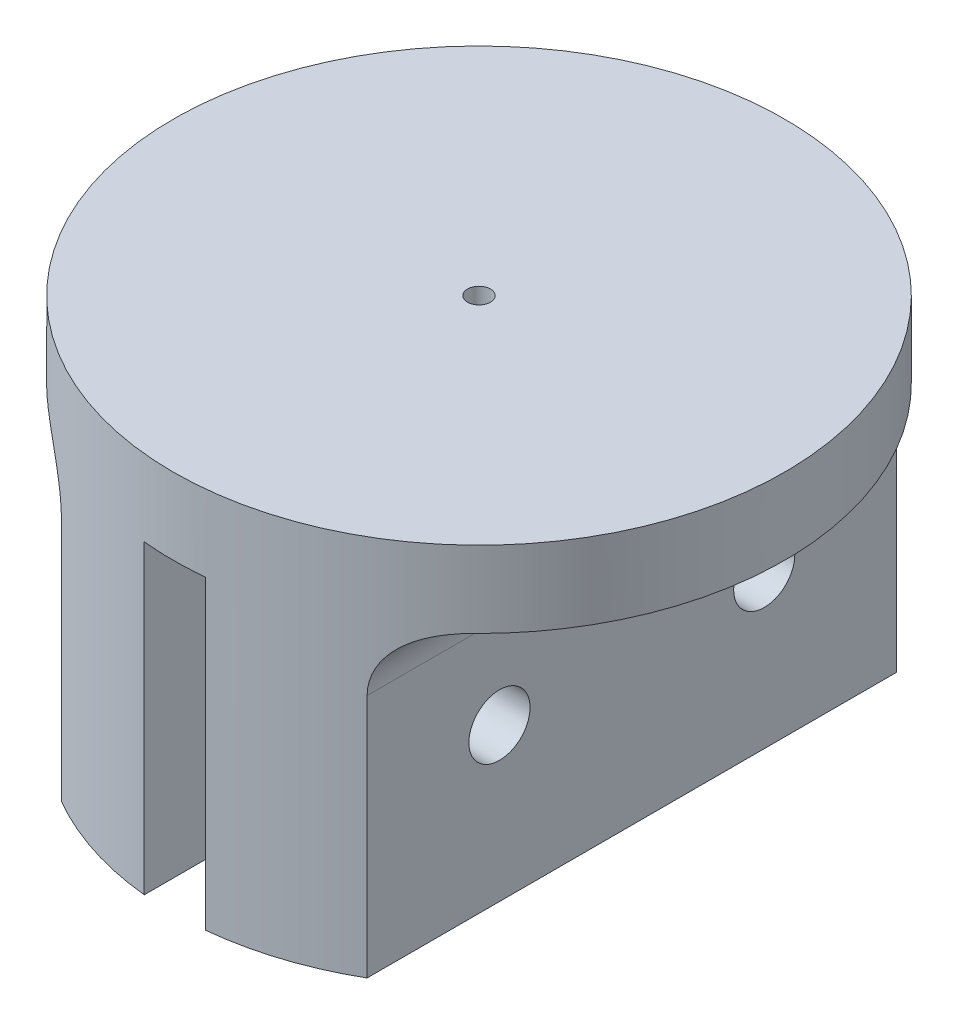
ISO-10303-21;
HEADER;
FILE_DESCRIPTION(('STEP AP214'),'2;1');
FILE_NAME('part.step','',(''),(''),'','','');
FILE_SCHEMA(('AUTOMOTIVE_DESIGN { 1 0 10303 214 1 1 1 1 }'));
ENDSEC;
DATA;
#1=APPLICATION_CONTEXT('core data for automotive mechanical design processes');
#2=APPLICATION_PROTOCOL_DEFINITION('international standard','automotive_design',2000,#1);
#3=PRODUCT_CONTEXT('',#1,'mechanical');
#4=PRODUCT('Part','Part','',(#3));
#5=PRODUCT_RELATED_PRODUCT_CATEGORY('part','',(#4));
#6=PRODUCT_DEFINITION_FORMATION('','',#4);
#7=PRODUCT_DEFINITION_CONTEXT('part definition',#1,'design');
#8=PRODUCT_DEFINITION('design','',#6,#7);
#9=PRODUCT_DEFINITION_SHAPE('','',#8);
#10=(LENGTH_UNIT() NAMED_UNIT(*) SI_UNIT(.MILLI.,.METRE.));
#11=(NAMED_UNIT(*) PLANE_ANGLE_UNIT() SI_UNIT($,.RADIAN.));
#12=(NAMED_UNIT(*) SI_UNIT($,.STERADIAN.) SOLID_ANGLE_UNIT());
#13=UNCERTAINTY_MEASURE_WITH_UNIT(LENGTH_MEASURE(1.E-05),#10,'distance_accuracy_value','');
#14=(GEOMETRIC_REPRESENTATION_CONTEXT(3) GLOBAL_UNCERTAINTY_ASSIGNED_CONTEXT((#13)) GLOBAL_UNIT_ASSIGNED_CONTEXT((#10,
#11,#12)) REPRESENTATION_CONTEXT('',''));
#15=CARTESIAN_POINT('',(0.,0.,0.));
#16=DIRECTION('',(0.,0.,1.));
#17=DIRECTION('',(1.,0.,0.));
#18=AXIS2_PLACEMENT_3D('',#15,#16,#17);
#19=CARTESIAN_POINT('',(-2.,20.,-20.7716194546899));
#20=DIRECTION('',(1.,0.,0.));
#21=DIRECTION('',(0.,0.,-1.));
#22=AXIS2_PLACEMENT_3D('',#19,#20,#21);
#23=PLANE('',#22);
#24=CARTESIAN_POINT('',(-1.99999999999999,10.,8.66025403784438));
#25=DIRECTION('',(1.,0.,0.));
#26=DIRECTION('',(0.,0.,-1.));
#27=AXIS2_PLACEMENT_3D('',#24,#25,#26);
#28=CIRCLE('',#27,2.);
#29=CARTESIAN_POINT('',(-2.,10.,6.66025403784438));
#30=VERTEX_POINT('',#29);
#31=EDGE_CURVE('E133',#30,#30,#28,.F.);
#32=ORIENTED_EDGE('',*,*,#31,.T.);
#33=EDGE_LOOP('',(#32));
#34=FACE_BOUND('',#33,.T.);
#35=DIRECTION('',(0.,-1.,0.));
#36=VECTOR('',#35,1.);
#37=CARTESIAN_POINT('',(-1.99999999999999,25.,19.8997487421324));
#38=LINE('',#37,#36);
#39=CARTESIAN_POINT('',(-1.99999999999999,20.,19.8997487421324));
#40=VERTEX_POINT('',#39);
#41=CARTESIAN_POINT('',(-1.99999999999999,0.,19.8997487421324));
#42=VERTEX_POINT('',#41);
#43=EDGE_CURVE('E165',#40,#42,#38,.T.);
#44=ORIENTED_EDGE('',*,*,#43,.T.);
#45=DIRECTION('',(0.,0.,1.));
#46=VECTOR('',#45,1.);
#47=CARTESIAN_POINT('',(-2.,0.,-20.7716194546899));
#48=LINE('',#47,#46);
#49=CARTESIAN_POINT('',(-2.,0.,-19.8997487421324));
#50=VERTEX_POINT('',#49);
#51=EDGE_CURVE('E261',#50,#42,#48,.T.);
#52=ORIENTED_EDGE('',*,*,#51,.F.);
#53=DIRECTION('',(0.,-1.,0.));
#54=VECTOR('',#53,1.);
#55=CARTESIAN_POINT('',(-2.,25.,-19.8997487421324));
#56=LINE('',#55,#54);
#57=CARTESIAN_POINT('',(-2.,20.,-19.8997487421324));
#58=VERTEX_POINT('',#57);
#59=EDGE_CURVE('E176',#50,#58,#56,.F.);
#60=ORIENTED_EDGE('',*,*,#59,.T.);
#61=DIRECTION('',(0.,0.,1.));
#62=VECTOR('',#61,1.);
#63=CARTESIAN_POINT('',(-2.,20.,-20.7716194546899));
#64=LINE('',#63,#62);
#65=EDGE_CURVE('E268',#58,#40,#64,.T.);
#66=ORIENTED_EDGE('',*,*,#65,.T.);
#67=EDGE_LOOP('',(#44,#52,#60,#66));
#68=FACE_BOUND('',#67,.T.);
#69=CARTESIAN_POINT('',(-2.,10.,-8.66025403784438));
#70=DIRECTION('',(1.,0.,0.));
#71=DIRECTION('',(0.,0.,-1.));
#72=AXIS2_PLACEMENT_3D('',#69,#70,#71);
#73=CIRCLE('',#72,2.);
#74=CARTESIAN_POINT('',(-2.,10.,-10.6602540378444));
#75=VERTEX_POINT('',#74);
#76=EDGE_CURVE('E191',#75,#75,#73,.F.);
#77=ORIENTED_EDGE('',*,*,#76,.T.);
#78=EDGE_LOOP('',(#77));
#79=FACE_BOUND('',#78,.T.);
#80=ADVANCED_FACE('F33',(#34,#68,#79),#23,.T.);
#81=CARTESIAN_POINT('',(2.,20.,-20.7716194546899));
#82=DIRECTION('',(-1.,0.,0.));
#83=DIRECTION('',(0.,0.,1.));
#84=AXIS2_PLACEMENT_3D('',#81,#82,#83);
#85=PLANE('',#84);
#86=CARTESIAN_POINT('',(2.,10.,8.66025403784438));
#87=DIRECTION('',(-1.,0.,0.));
#88=DIRECTION('',(0.,0.,1.));
#89=AXIS2_PLACEMENT_3D('',#86,#87,#88);
#90=CIRCLE('',#89,2.);
#91=CARTESIAN_POINT('',(2.,10.,10.6602540378444));
#92=VERTEX_POINT('',#91);
#93=EDGE_CURVE('E277',#92,#92,#90,.F.);
#94=ORIENTED_EDGE('',*,*,#93,.T.);
#95=EDGE_LOOP('',(#94));
#96=FACE_BOUND('',#95,.T.);
#97=DIRECTION('',(0.,-1.,0.));
#98=VECTOR('',#97,1.);
#99=CARTESIAN_POINT('',(2.,25.,-19.8997487421324));
#100=LINE('',#99,#98);
#101=CARTESIAN_POINT('',(2.,20.,-19.8997487421324));
#102=VERTEX_POINT('',#101);
#103=CARTESIAN_POINT('',(2.,0.,-19.8997487421324));
#104=VERTEX_POINT('',#103);
#105=EDGE_CURVE('E171',#102,#104,#100,.T.);
#106=ORIENTED_EDGE('',*,*,#105,.T.);
#107=DIRECTION('',(0.,0.,-1.));
#108=VECTOR('',#107,1.);
#109=CARTESIAN_POINT('',(2.,0.,-20.7716194546899));
#110=LINE('',#109,#108);
#111=CARTESIAN_POINT('',(2.00000000000001,0.,19.8997487421324));
#112=VERTEX_POINT('',#111);
#113=EDGE_CURVE('E137',#112,#104,#110,.T.);
#114=ORIENTED_EDGE('',*,*,#113,.F.);
#115=DIRECTION('',(0.,-1.,0.));
#116=VECTOR('',#115,1.);
#117=CARTESIAN_POINT('',(2.00000000000001,25.,19.8997487421324));
#118=LINE('',#117,#116);
#119=CARTESIAN_POINT('',(2.00000000000001,20.,19.8997487421324));
#120=VERTEX_POINT('',#119);
#121=EDGE_CURVE('E161',#112,#120,#118,.F.);
#122=ORIENTED_EDGE('',*,*,#121,.T.);
#123=DIRECTION('',(0.,0.,-1.));
#124=VECTOR('',#123,1.);
#125=CARTESIAN_POINT('',(2.,20.,-20.7716194546899));
#126=LINE('',#125,#124);
#127=EDGE_CURVE('E270',#120,#102,#126,.T.);
#128=ORIENTED_EDGE('',*,*,#127,.T.);
#129=EDGE_LOOP('',(#106,#114,#122,#128));
#130=FACE_BOUND('',#129,.T.);
#131=CARTESIAN_POINT('',(2.,10.,-8.66025403784438));
#132=DIRECTION('',(-1.,0.,0.));
#133=DIRECTION('',(0.,0.,1.));
#134=AXIS2_PLACEMENT_3D('',#131,#132,#133);
#135=CIRCLE('',#134,2.);
#136=CARTESIAN_POINT('',(2.,10.,-6.66025403784438));
#137=VERTEX_POINT('',#136);
#138=EDGE_CURVE('E284',#137,#137,#135,.F.);
#139=ORIENTED_EDGE('',*,*,#138,.T.);
#140=EDGE_LOOP('',(#139));
#141=FACE_BOUND('',#140,.T.);
#142=ADVANCED_FACE('F230',(#96,#130,#141),#85,.T.);
#143=CARTESIAN_POINT('',(-10.,20.,-20.));
#144=DIRECTION('',(-1.,0.,0.));
#145=DIRECTION('',(0.,0.,1.));
#146=AXIS2_PLACEMENT_3D('',#143,#144,#145);
#147=PLANE('',#146);
#148=CARTESIAN_POINT('',(-9.99999999999999,10.,8.66025403784438));
#149=DIRECTION('',(-1.,0.,0.));
#150=DIRECTION('',(0.,0.,1.));
#151=AXIS2_PLACEMENT_3D('',#148,#149,#150);
#152=CIRCLE('',#151,2.);
#153=CARTESIAN_POINT('',(-9.99999999999999,10.,10.6602540378444));
#154=VERTEX_POINT('',#153);
#155=EDGE_CURVE('E190',#154,#154,#152,.F.);
#156=ORIENTED_EDGE('',*,*,#155,.T.);
#157=EDGE_LOOP('',(#156));
#158=FACE_BOUND('',#157,.T.);
#159=DIRECTION('',(0.,-1.,0.));
#160=VECTOR('',#159,1.);
#161=CARTESIAN_POINT('',(-9.99999999999999,25.,17.3205080756888));
#162=LINE('',#161,#160);
#163=CARTESIAN_POINT('',(-9.99999999999999,0.,17.3205080756888));
#164=VERTEX_POINT('',#163);
#165=CARTESIAN_POINT('',(-9.99999999999999,16.,17.3205080756888));
#166=VERTEX_POINT('',#165);
#167=EDGE_CURVE('E181',#164,#166,#162,.F.);
#168=ORIENTED_EDGE('',*,*,#167,.T.);
#169=DIRECTION('',(0.,0.,-1.));
#170=VECTOR('',#169,1.);
#171=CARTESIAN_POINT('',(-10.,16.,-20.));
#172=LINE('',#171,#170);
#173=CARTESIAN_POINT('',(-10.,16.,-17.3205080756888));
#174=VERTEX_POINT('',#173);
#175=EDGE_CURVE('E186',#166,#174,#172,.T.);
#176=ORIENTED_EDGE('',*,*,#175,.T.);
#177=DIRECTION('',(0.,-1.,0.));
#178=VECTOR('',#177,1.);
#179=CARTESIAN_POINT('',(-10.,25.,-17.3205080756888));
#180=LINE('',#179,#178);
#181=CARTESIAN_POINT('',(-10.,0.,-17.3205080756888));
#182=VERTEX_POINT('',#181);
#183=EDGE_CURVE('E126',#174,#182,#180,.T.);
#184=ORIENTED_EDGE('',*,*,#183,.T.);
#185=DIRECTION('',(0.,0.,-1.));
#186=VECTOR('',#185,1.);
#187=CARTESIAN_POINT('',(-10.,0.,-20.));
#188=LINE('',#187,#186);
#189=EDGE_CURVE('E258',#164,#182,#188,.T.);
#190=ORIENTED_EDGE('',*,*,#189,.F.);
#191=EDGE_LOOP('',(#168,#176,#184,#190));
#192=FACE_BOUND('',#191,.T.);
#193=CARTESIAN_POINT('',(-10.,10.,-8.66025403784438));
#194=DIRECTION('',(-1.,0.,0.));
#195=DIRECTION('',(0.,0.,1.));
#196=AXIS2_PLACEMENT_3D('',#193,#194,#195);
#197=CIRCLE('',#196,2.);
#198=CARTESIAN_POINT('',(-10.,10.,-6.66025403784438));
#199=VERTEX_POINT('',#198);
#200=EDGE_CURVE('E195',#199,#199,#197,.F.);
#201=ORIENTED_EDGE('',*,*,#200,.T.);
#202=EDGE_LOOP('',(#201));
#203=FACE_BOUND('',#202,.T.);
#204=ADVANCED_FACE('F236',(#158,#192,#203),#147,.T.);
#205=CARTESIAN_POINT('',(10.,20.,-20.7716194546899));
#206=DIRECTION('',(1.,0.,0.));
#207=DIRECTION('',(0.,0.,-1.));
#208=AXIS2_PLACEMENT_3D('',#205,#206,#207);
#209=PLANE('',#208);
#210=CARTESIAN_POINT('',(10.,10.,8.66025403784438));
#211=DIRECTION('',(1.,0.,0.));
#212=DIRECTION('',(0.,0.,-1.));
#213=AXIS2_PLACEMENT_3D('',#210,#211,#212);
#214=CIRCLE('',#213,2.);
#215=CARTESIAN_POINT('',(10.,10.,6.66025403784438));
#216=VERTEX_POINT('',#215);
#217=EDGE_CURVE('E187',#216,#216,#214,.F.);
#218=ORIENTED_EDGE('',*,*,#217,.T.);
#219=EDGE_LOOP('',(#218));
#220=FACE_BOUND('',#219,.T.);
#221=DIRECTION('',(0.,-1.,0.));
#222=VECTOR('',#221,1.);
#223=CARTESIAN_POINT('',(10.,25.,-17.3205080756888));
#224=LINE('',#223,#222);
#225=CARTESIAN_POINT('',(10.,0.,-17.3205080756888));
#226=VERTEX_POINT('',#225);
#227=CARTESIAN_POINT('',(10.,16.,-17.3205080756888));
#228=VERTEX_POINT('',#227);
#229=EDGE_CURVE('E118',#226,#228,#224,.F.);
#230=ORIENTED_EDGE('',*,*,#229,.T.);
#231=DIRECTION('',(0.,0.,1.));
#232=VECTOR('',#231,1.);
#233=CARTESIAN_POINT('',(10.,16.,17.3205080756888));
#234=LINE('',#233,#232);
#235=CARTESIAN_POINT('',(10.,16.,17.3205080756888));
#236=VERTEX_POINT('',#235);
#237=EDGE_CURVE('E200',#228,#236,#234,.T.);
#238=ORIENTED_EDGE('',*,*,#237,.T.);
#239=DIRECTION('',(0.,-1.,0.));
#240=VECTOR('',#239,1.);
#241=CARTESIAN_POINT('',(10.,25.,17.3205080756888));
#242=LINE('',#241,#240);
#243=CARTESIAN_POINT('',(10.,0.,17.3205080756888));
#244=VERTEX_POINT('',#243);
#245=EDGE_CURVE('E120',#236,#244,#242,.T.);
#246=ORIENTED_EDGE('',*,*,#245,.T.);
#247=DIRECTION('',(0.,0.,-1.));
#248=VECTOR('',#247,1.);
#249=CARTESIAN_POINT('',(10.,0.,0.));
#250=LINE('',#249,#248);
#251=EDGE_CURVE('E113',#244,#226,#250,.T.);
#252=ORIENTED_EDGE('',*,*,#251,.T.);
#253=EDGE_LOOP('',(#230,#238,#246,#252));
#254=FACE_BOUND('',#253,.T.);
#255=CARTESIAN_POINT('',(10.,10.,-8.66025403784438));
#256=DIRECTION('',(1.,0.,0.));
#257=DIRECTION('',(0.,0.,-1.));
#258=AXIS2_PLACEMENT_3D('',#255,#256,#257);
#259=CIRCLE('',#258,2.);
#260=CARTESIAN_POINT('',(10.,10.,-10.6602540378444));
#261=VERTEX_POINT('',#260);
#262=EDGE_CURVE('E192',#261,#261,#259,.F.);
#263=ORIENTED_EDGE('',*,*,#262,.T.);
#264=EDGE_LOOP('',(#263));
#265=FACE_BOUND('',#264,.T.);
#266=ADVANCED_FACE('F115',(#220,#254,#265),#209,.T.);
#267=CARTESIAN_POINT('',(0.,25.,0.));
#268=DIRECTION('',(0.,-1.,0.));
#269=DIRECTION('',(0.,0.,-1.));
#270=AXIS2_PLACEMENT_3D('',#267,#268,#269);
#271=CYLINDRICAL_SURFACE('',#270,20.);
#272=CARTESIAN_POINT('',(0.,25.,0.));
#273=DIRECTION('',(0.,1.,0.));
#274=DIRECTION('',(0.,0.,1.));
#275=AXIS2_PLACEMENT_3D('',#272,#273,#274);
#276=CIRCLE('',#275,20.);
#277=CARTESIAN_POINT('',(0.,25.,20.));
#278=VERTEX_POINT('',#277);
#279=EDGE_CURVE('E142',#278,#278,#276,.T.);
#280=ORIENTED_EDGE('',*,*,#279,.F.);
#281=EDGE_LOOP('',(#280));
#282=FACE_BOUND('',#281,.T.);
#283=ORIENTED_EDGE('',*,*,#245,.F.);
#284=CARTESIAN_POINT('',(10.,16.,17.3205080756888));
#285=CARTESIAN_POINT('',(9.99998240982223,16.1003362218394,17.320511331492));
#286=CARTESIAN_POINT('',(10.0037745142716,16.20066747863,17.3183286585032));
#287=CARTESIAN_POINT('',(10.0188491979863,16.4005542615852,17.3096158329185));
#288=CARTESIAN_POINT('',(10.0301301305922,16.5001099534151,17.3030866360445));
#289=CARTESIAN_POINT('',(10.0600036733417,16.6973944536884,17.2857341571671));
#290=CARTESIAN_POINT('',(10.0785717292087,16.7951282544872,17.2749252946069));
#291=CARTESIAN_POINT('',(10.1227748917953,16.9884090942246,17.2490604936271));
#292=CARTESIAN_POINT('',(10.1484101256137,17.0839560938017,17.2340044788251));
#293=CARTESIAN_POINT('',(10.2064126824952,17.2721563212278,17.1997171970859));
#294=CARTESIAN_POINT('',(10.2387761387923,17.3648111761922,17.1804883280461));
#295=CARTESIAN_POINT('',(10.309841091253,17.5466995705573,17.1379371884902));
#296=CARTESIAN_POINT('',(10.3485449495446,17.6359318195113,17.1146133921687));
#297=CARTESIAN_POINT('',(10.4735135043577,17.8976788447137,17.0386333568388));
#298=CARTESIAN_POINT('',(10.5686645534326,18.0643376020453,16.979951432296));
#299=CARTESIAN_POINT('',(10.7818919584229,18.3836898911447,16.8453904078882));
#300=CARTESIAN_POINT('',(10.9006466420427,18.5357022320962,16.7689873226603));
#301=CARTESIAN_POINT('',(11.1537601533906,18.816859906221,16.6017055216621));
#302=CARTESIAN_POINT('',(11.288116116142,18.9460094268983,16.5108294625342));
#303=CARTESIAN_POINT('',(11.5835222680817,19.1940509663896,16.3051501853863));
#304=CARTESIAN_POINT('',(11.745870096893,19.310101156311,16.1888007797441));
#305=CARTESIAN_POINT('',(12.0784199463861,19.5136402514177,15.9422310154508));
#306=CARTESIAN_POINT('',(12.2486420027151,19.6010511413939,15.8119740290349));
#307=CARTESIAN_POINT('',(12.5530942422525,19.7319467708479,15.5707639588251));
#308=CARTESIAN_POINT('',(12.6868151072839,19.7808885805504,15.4620520720949));
#309=CARTESIAN_POINT('',(12.9542504706705,19.8634183471739,15.2386931312246));
#310=CARTESIAN_POINT('',(13.0879648393469,19.8969914999622,15.1240404723475));
#311=CARTESIAN_POINT('',(13.3530760804316,19.9496413435779,14.8904786228203));
#312=CARTESIAN_POINT('',(13.4844818257277,19.9687997078108,14.7715974724434));
#313=CARTESIAN_POINT('',(13.7445035217402,19.9939596516192,14.5299785292068));
#314=CARTESIAN_POINT('',(13.8731246178339,19.9999879974254,14.4072491006651));
#315=CARTESIAN_POINT('',(14.,20.,14.2828568570857));
#316=B_SPLINE_CURVE_WITH_KNOTS('',3,(#284,#285,#286,#287,#288,#289,#290,#291,#292,#293,#294,
#295,#296,#297,#298,#299,#300,#301,#302,#303,#304,#305,#306,#307,#308,#309,#310,#311,#312,#313,
#314,#315),.UNSPECIFIED.,.F.,.F.,(4,2,2,2,2,2,2,2,2,2,2,2,2,2,2,4),(0.,0.300905633390544,
0.601745124917364,0.901579510033324,1.20141928783072,1.5010872192,1.80086704733887,
2.40013130980564,3.02009430324761,3.63994362788023,4.33036278472294,5.02264734432708,
5.55933856768915,6.09654568616441,6.63068560968662,7.16373563784314),.UNSPECIFIED.);
#317=CARTESIAN_POINT('',(14.,20.,14.2828568570857));
#318=VERTEX_POINT('',#317);
#319=EDGE_CURVE('E46',#236,#318,#316,.T.);
#320=ORIENTED_EDGE('',*,*,#319,.T.);
#321=CARTESIAN_POINT('',(0.,20.,0.));
#322=DIRECTION('',(0.,-1.,0.));
#323=DIRECTION('',(0.,0.,-1.));
#324=AXIS2_PLACEMENT_3D('',#321,#322,#323);
#325=CIRCLE('',#324,20.);
#326=CARTESIAN_POINT('',(14.,20.,-14.2828568570857));
#327=VERTEX_POINT('',#326);
#328=EDGE_CURVE('E125',#327,#318,#325,.T.);
#329=ORIENTED_EDGE('',*,*,#328,.F.);
#330=CARTESIAN_POINT('',(14.,20.,-14.2828568570857));
#331=CARTESIAN_POINT('',(13.8796638890662,19.9999883590885,-14.4008324692181));
#332=CARTESIAN_POINT('',(13.7577703750352,19.9945661741248,-14.5173070575826));
#333=CARTESIAN_POINT('',(13.5114850403326,19.9719896999701,-14.7467956733145));
#334=CARTESIAN_POINT('',(13.3870895858352,19.9548169386029,-14.8598039588979));
#335=CARTESIAN_POINT('',(13.1358765244377,19.9076490507508,-15.0823447680371));
#336=CARTESIAN_POINT('',(13.0090478120207,19.8775601197332,-15.1918454401942));
#337=CARTESIAN_POINT('',(12.7551719449662,19.8036693833049,-15.40562145239));
#338=CARTESIAN_POINT('',(12.6281249865786,19.7598765282601,-15.5099001516063));
#339=CARTESIAN_POINT('',(12.3049173218837,19.6292639629767,-15.7687056380636));
#340=CARTESIAN_POINT('',(12.1094069840706,19.5320440293125,-15.91911369332));
#341=CARTESIAN_POINT('',(11.8238235224084,19.3580785262342,-16.1310693688207));
#342=CARTESIAN_POINT('',(11.7299726934499,19.2954546726787,-16.1994019192205));
#343=CARTESIAN_POINT('',(11.5457854562149,19.1606694710723,-16.3311849586099));
#344=CARTESIAN_POINT('',(11.4554472779689,19.0885130091206,-16.3946379225286));
#345=CARTESIAN_POINT('',(11.2785049709962,18.9338405718235,-16.5168709575035));
#346=CARTESIAN_POINT('',(11.1919501497416,18.8512235568235,-16.575594818032));
#347=CARTESIAN_POINT('',(11.0249300655803,18.6764817143797,-16.6871506114413));
#348=CARTESIAN_POINT('',(10.9444616367507,18.5843618897314,-16.739985614363));
#349=CARTESIAN_POINT('',(10.7908790780921,18.3909817207547,-16.8393974057961));
#350=CARTESIAN_POINT('',(10.7177674037898,18.2897183457629,-16.8859721064836));
#351=CARTESIAN_POINT('',(10.5802737349535,18.0787765239117,-16.9724602797926));
#352=CARTESIAN_POINT('',(10.5158896993879,17.9691000539525,-17.0123753103399));
#353=CARTESIAN_POINT('',(10.4058159799283,17.7589154089031,-17.0798867819652));
#354=CARTESIAN_POINT('',(10.3587694098285,17.65941930972,-17.108431265925));
#355=CARTESIAN_POINT('',(10.2726572262111,17.4557254030872,-17.1602750850384));
#356=CARTESIAN_POINT('',(10.2335902330067,17.3515284122422,-17.1835753270043));
#357=CARTESIAN_POINT('',(10.1641038917437,17.1394443716107,-17.2247677656953));
#358=CARTESIAN_POINT('',(10.1336706684132,17.0315635583408,-17.2426686426629));
#359=CARTESIAN_POINT('',(10.0818712786874,16.8129452722441,-17.2730069815222));
#360=CARTESIAN_POINT('',(10.0605005047439,16.7022092815057,-17.2854472198355));
#361=CARTESIAN_POINT('',(10.0292731534472,16.4929998608571,-17.3035827807113));
#362=CARTESIAN_POINT('',(10.0183018631139,16.3947476227772,-17.3099323502435));
#363=CARTESIAN_POINT('',(10.0036629566944,16.1976665808799,-17.3183931207938));
#364=CARTESIAN_POINT('',(9.99998455069885,16.0988388461288,-17.3205105833023));
#365=CARTESIAN_POINT('',(10.,16.,-17.3205080756888));
#366=B_SPLINE_CURVE_WITH_KNOTS('',3,(#330,#331,#332,#333,#334,#335,#336,#337,#338,#339,#340,
#341,#342,#343,#344,#345,#346,#347,#348,#349,#350,#351,#352,#353,#354,#355,#356,#357,#358,#359,
#360,#361,#362,#363,#364,#365),.UNSPECIFIED.,.F.,.F.,(4,2,2,2,2,2,2,2,2,2,2,2,2,2,2,2,2,4),(0.,
0.505548359721142,1.0118932844657,1.5219794977366,2.03173325419862,2.82351048628494,
3.21884336464337,3.61397438901523,4.01326412064231,4.41234470697278,4.81155805902912,
5.21067789002696,5.55130360648254,5.89187037803847,6.23188668582308,6.57172991399145,
6.86857476114565,7.16498009409525),.UNSPECIFIED.);
#367=EDGE_CURVE('E11',#327,#228,#366,.T.);
#368=ORIENTED_EDGE('',*,*,#367,.T.);
#369=ORIENTED_EDGE('',*,*,#229,.F.);
#370=CARTESIAN_POINT('',(0.,0.,0.));
#371=DIRECTION('',(0.,1.,0.));
#372=DIRECTION('',(0.,0.,1.));
#373=AXIS2_PLACEMENT_3D('',#370,#371,#372);
#374=CIRCLE('',#373,20.);
#375=EDGE_CURVE('E130',#226,#104,#374,.T.);
#376=ORIENTED_EDGE('',*,*,#375,.T.);
#377=ORIENTED_EDGE('',*,*,#105,.F.);
#378=CARTESIAN_POINT('',(0.,20.,0.));
#379=DIRECTION('',(0.,1.,0.));
#380=DIRECTION('',(0.,0.,1.));
#381=AXIS2_PLACEMENT_3D('',#378,#379,#380);
#382=CIRCLE('',#381,20.);
#383=EDGE_CURVE('E152',#102,#58,#382,.T.);
#384=ORIENTED_EDGE('',*,*,#383,.T.);
#385=ORIENTED_EDGE('',*,*,#59,.F.);
#386=EDGE_CURVE('E139',#50,#182,#374,.T.);
#387=ORIENTED_EDGE('',*,*,#386,.T.);
#388=ORIENTED_EDGE('',*,*,#183,.F.);
#389=CARTESIAN_POINT('',(-10.,16.,-17.3205080756888));
#390=CARTESIAN_POINT('',(-9.99998240982222,16.1003362218394,-17.320511331492));
#391=CARTESIAN_POINT('',(-10.0037745142716,16.20066747863,-17.3183286585032));
#392=CARTESIAN_POINT('',(-10.0188491979863,16.4005542615852,-17.3096158329185));
#393=CARTESIAN_POINT('',(-10.0301301305922,16.5001099534151,-17.3030866360445));
#394=CARTESIAN_POINT('',(-10.0600036733417,16.6973944536884,-17.2857341571671));
#395=CARTESIAN_POINT('',(-10.0785717292087,16.7951282544872,-17.2749252946069));
#396=CARTESIAN_POINT('',(-10.1227748917953,16.9884090942247,-17.2490604936271));
#397=CARTESIAN_POINT('',(-10.1484101256137,17.0839560938017,-17.2340044788251));
#398=CARTESIAN_POINT('',(-10.2064126824952,17.2721563212278,-17.1997171970859));
#399=CARTESIAN_POINT('',(-10.2387761387923,17.3648111761922,-17.1804883280461));
#400=CARTESIAN_POINT('',(-10.309841091253,17.5466995705573,-17.1379371884902));
#401=CARTESIAN_POINT('',(-10.3485449495446,17.6359318195113,-17.1146133921687));
#402=CARTESIAN_POINT('',(-10.4735135043577,17.8976788447137,-17.0386333568388));
#403=CARTESIAN_POINT('',(-10.5686645534326,18.0643376020453,-16.979951432296));
#404=CARTESIAN_POINT('',(-10.7818919584229,18.3836898911447,-16.8453904078882));
#405=CARTESIAN_POINT('',(-10.9006466420427,18.5357022320962,-16.7689873226603));
#406=CARTESIAN_POINT('',(-11.1537601533906,18.816859906221,-16.6017055216621));
#407=CARTESIAN_POINT('',(-11.288116116142,18.9460094268983,-16.5108294625342));
#408=CARTESIAN_POINT('',(-11.5835222680817,19.1940509663896,-16.3051501853863));
#409=CARTESIAN_POINT('',(-11.745870096893,19.310101156311,-16.1888007797441));
#410=CARTESIAN_POINT('',(-12.0784199463861,19.5136402514177,-15.9422310154508));
#411=CARTESIAN_POINT('',(-12.2486420027151,19.6010511413939,-15.8119740290349));
#412=CARTESIAN_POINT('',(-12.5530942422525,19.7319467708479,-15.5707639588251));
#413=CARTESIAN_POINT('',(-12.6868151072839,19.7808885805504,-15.4620520720949));
#414=CARTESIAN_POINT('',(-12.9542504706705,19.8634183471739,-15.2386931312246));
#415=CARTESIAN_POINT('',(-13.0879648393469,19.8969914999622,-15.1240404723475));
#416=CARTESIAN_POINT('',(-13.3530760804316,19.9496413435779,-14.8904786228203));
#417=CARTESIAN_POINT('',(-13.4844818257277,19.9687997078108,-14.7715974724434));
#418=CARTESIAN_POINT('',(-13.7445035217402,19.9939596516192,-14.5299785292068));
#419=CARTESIAN_POINT('',(-13.8731246178338,19.9999879974254,-14.4072491006651));
#420=CARTESIAN_POINT('',(-14.,20.,-14.2828568570857));
#421=B_SPLINE_CURVE_WITH_KNOTS('',3,(#389,#390,#391,#392,#393,#394,#395,#396,#397,#398,#399,
#400,#401,#402,#403,#404,#405,#406,#407,#408,#409,#410,#411,#412,#413,#414,#415,#416,#417,#418,
#419,#420),.UNSPECIFIED.,.F.,.F.,(4,2,2,2,2,2,2,2,2,2,2,2,2,2,2,4),(0.,0.300905633390547,
0.601745124917371,0.901579510033327,1.20141928783072,1.5010872192,1.80086704733888,
2.40013130980564,3.02009430324762,3.63994362788023,4.33036278472293,5.02264734432708,
5.55933856768915,6.09654568616441,6.63068560968662,7.16373563784315),.UNSPECIFIED.);
#422=CARTESIAN_POINT('',(-14.,20.,-14.2828568570857));
#423=VERTEX_POINT('',#422);
#424=EDGE_CURVE('E203',#174,#423,#421,.T.);
#425=ORIENTED_EDGE('',*,*,#424,.T.);
#426=CARTESIAN_POINT('',(0.,20.,0.));
#427=DIRECTION('',(0.,1.,0.));
#428=DIRECTION('',(0.,0.,1.));
#429=AXIS2_PLACEMENT_3D('',#426,#427,#428);
#430=CIRCLE('',#429,20.);
#431=CARTESIAN_POINT('',(-14.,20.,14.2828568570857));
#432=VERTEX_POINT('',#431);
#433=EDGE_CURVE('E178',#423,#432,#430,.T.);
#434=ORIENTED_EDGE('',*,*,#433,.T.);
#435=CARTESIAN_POINT('',(-14.,20.,14.2828568570857));
#436=CARTESIAN_POINT('',(-13.8796638890662,19.9999883590885,14.4008324692181));
#437=CARTESIAN_POINT('',(-13.7577703750352,19.9945661741248,14.5173070575826));
#438=CARTESIAN_POINT('',(-13.5114850403326,19.9719896999702,14.7467956733145));
#439=CARTESIAN_POINT('',(-13.3870895858352,19.9548169386029,14.8598039588979));
#440=CARTESIAN_POINT('',(-13.1358765244377,19.9076490507508,15.0823447680371));
#441=CARTESIAN_POINT('',(-13.0090478120207,19.8775601197332,15.1918454401942));
#442=CARTESIAN_POINT('',(-12.7551719449662,19.8036693833049,15.40562145239));
#443=CARTESIAN_POINT('',(-12.6281249865786,19.7598765282601,15.5099001516063));
#444=CARTESIAN_POINT('',(-12.3049173218837,19.6292639629767,15.7687056380636));
#445=CARTESIAN_POINT('',(-12.1094069840706,19.5320440293125,15.9191136933201));
#446=CARTESIAN_POINT('',(-11.8238235224084,19.3580785262342,16.1310693688207));
#447=CARTESIAN_POINT('',(-11.7299726934499,19.2954546726787,16.1994019192205));
#448=CARTESIAN_POINT('',(-11.5457854562148,19.1606694710723,16.3311849586099));
#449=CARTESIAN_POINT('',(-11.4554472779689,19.0885130091206,16.3946379225286));
#450=CARTESIAN_POINT('',(-11.2785049709962,18.9338405718235,16.5168709575035));
#451=CARTESIAN_POINT('',(-11.1919501497416,18.8512235568235,16.575594818032));
#452=CARTESIAN_POINT('',(-11.0249300655803,18.6764817143797,16.6871506114413));
#453=CARTESIAN_POINT('',(-10.9444616367507,18.5843618897314,16.739985614363));
#454=CARTESIAN_POINT('',(-10.7908790780921,18.3909817207547,16.8393974057961));
#455=CARTESIAN_POINT('',(-10.7177674037898,18.2897183457628,16.8859721064836));
#456=CARTESIAN_POINT('',(-10.5802737349535,18.0787765239117,16.9724602797926));
#457=CARTESIAN_POINT('',(-10.5158896993878,17.9691000539525,17.0123753103399));
#458=CARTESIAN_POINT('',(-10.4058159799283,17.7589154089031,17.0798867819653));
#459=CARTESIAN_POINT('',(-10.3587694098285,17.65941930972,17.108431265925));
#460=CARTESIAN_POINT('',(-10.272657226211,17.4557254030872,17.1602750850384));
#461=CARTESIAN_POINT('',(-10.2335902330067,17.3515284122422,17.1835753270043));
#462=CARTESIAN_POINT('',(-10.1641038917437,17.1394443716107,17.2247677656953));
#463=CARTESIAN_POINT('',(-10.1336706684132,17.0315635583408,17.2426686426629));
#464=CARTESIAN_POINT('',(-10.0818712786874,16.8129452722441,17.2730069815222));
#465=CARTESIAN_POINT('',(-10.0605005047439,16.7022092815057,17.2854472198355));
#466=CARTESIAN_POINT('',(-10.0292731534472,16.4929998608571,17.3035827807113));
#467=CARTESIAN_POINT('',(-10.0183018631139,16.3947476227772,17.3099323502435));
#468=CARTESIAN_POINT('',(-10.0036629566944,16.1976665808799,17.3183931207938));
#469=CARTESIAN_POINT('',(-9.99998455069885,16.0988388461288,17.3205105833023));
#470=CARTESIAN_POINT('',(-9.99999999999999,16.,17.3205080756888));
#471=B_SPLINE_CURVE_WITH_KNOTS('',3,(#435,#436,#437,#438,#439,#440,#441,#442,#443,#444,#445,
#446,#447,#448,#449,#450,#451,#452,#453,#454,#455,#456,#457,#458,#459,#460,#461,#462,#463,#464,
#465,#466,#467,#468,#469,#470),.UNSPECIFIED.,.F.,.F.,(4,2,2,2,2,2,2,2,2,2,2,2,2,2,2,2,2,4),(0.,
0.505548359721143,1.0118932844657,1.5219794977366,2.03173325419862,2.82351048628494,
3.21884336464337,3.61397438901523,4.01326412064231,4.41234470697279,4.81155805902913,
5.21067789002697,5.55130360648255,5.89187037803848,6.23188668582308,6.57172991399145,
6.86857476114565,7.16498009409525),.UNSPECIFIED.);
#472=EDGE_CURVE('E208',#432,#166,#471,.T.);
#473=ORIENTED_EDGE('',*,*,#472,.T.);
#474=ORIENTED_EDGE('',*,*,#167,.F.);
#475=EDGE_CURVE('E141',#164,#42,#374,.T.);
#476=ORIENTED_EDGE('',*,*,#475,.T.);
#477=ORIENTED_EDGE('',*,*,#43,.F.);
#478=EDGE_CURVE('E157',#40,#120,#382,.T.);
#479=ORIENTED_EDGE('',*,*,#478,.T.);
#480=ORIENTED_EDGE('',*,*,#121,.F.);
#481=EDGE_CURVE('E138',#112,#244,#374,.T.);
#482=ORIENTED_EDGE('',*,*,#481,.T.);
#483=EDGE_LOOP('',(#283,#320,#329,#368,#369,#376,#377,#384,#385,#387,#388,#425,#434,#473,#474,
#476,#477,#479,#480,#482));
#484=FACE_BOUND('',#483,.T.);
#485=ADVANCED_FACE('F128',(#282,#484),#271,.T.);
#486=CARTESIAN_POINT('',(0.,0.,0.));
#487=DIRECTION('',(0.,1.,0.));
#488=DIRECTION('',(0.,0.,1.));
#489=AXIS2_PLACEMENT_3D('',#486,#487,#488);
#490=PLANE('',#489);
#491=ORIENTED_EDGE('',*,*,#251,.F.);
#492=ORIENTED_EDGE('',*,*,#481,.F.);
#493=ORIENTED_EDGE('',*,*,#113,.T.);
#494=ORIENTED_EDGE('',*,*,#375,.F.);
#495=EDGE_LOOP('',(#491,#492,#493,#494));
#496=FACE_BOUND('',#495,.T.);
#497=ADVANCED_FACE('F136',(#496),#490,.F.);
#498=ORIENTED_EDGE('',*,*,#189,.T.);
#499=ORIENTED_EDGE('',*,*,#386,.F.);
#500=ORIENTED_EDGE('',*,*,#51,.T.);
#501=ORIENTED_EDGE('',*,*,#475,.F.);
#502=EDGE_LOOP('',(#498,#499,#500,#501));
#503=FACE_BOUND('',#502,.T.);
#504=ADVANCED_FACE('F250',(#503),#490,.F.);
#505=CARTESIAN_POINT('',(0.,25.,0.));
#506=DIRECTION('',(0.,1.,0.));
#507=DIRECTION('',(0.,0.,1.));
#508=AXIS2_PLACEMENT_3D('',#505,#506,#507);
#509=PLANE('',#508);
#510=ORIENTED_EDGE('',*,*,#279,.T.);
#511=EDGE_LOOP('',(#510));
#512=FACE_BOUND('',#511,.T.);
#513=CARTESIAN_POINT('',(0.,25.,0.));
#514=DIRECTION('',(0.,1.,0.));
#515=DIRECTION('',(0.,0.,1.));
#516=AXIS2_PLACEMENT_3D('',#513,#514,#515);
#517=CIRCLE('',#516,0.75);
#518=CARTESIAN_POINT('',(0.,25.,0.75));
#519=VERTEX_POINT('',#518);
#520=EDGE_CURVE('E146',#519,#519,#517,.T.);
#521=ORIENTED_EDGE('',*,*,#520,.F.);
#522=EDGE_LOOP('',(#521));
#523=FACE_BOUND('',#522,.T.);
#524=ADVANCED_FACE('F247',(#512,#523),#509,.T.);
#525=CARTESIAN_POINT('',(0.,25.,0.));
#526=DIRECTION('',(0.,-1.,0.));
#527=DIRECTION('',(0.,0.,-1.));
#528=AXIS2_PLACEMENT_3D('',#525,#526,#527);
#529=CYLINDRICAL_SURFACE('',#528,0.75);
#530=CARTESIAN_POINT('',(0.,20.,0.));
#531=DIRECTION('',(0.,1.,0.));
#532=DIRECTION('',(0.,0.,1.));
#533=AXIS2_PLACEMENT_3D('',#530,#531,#532);
#534=CIRCLE('',#533,0.75);
#535=CARTESIAN_POINT('',(0.,20.,0.75));
#536=VERTEX_POINT('',#535);
#537=EDGE_CURVE('E173',#536,#536,#534,.T.);
#538=ORIENTED_EDGE('',*,*,#537,.F.);
#539=EDGE_LOOP('',(#538));
#540=FACE_BOUND('',#539,.T.);
#541=ORIENTED_EDGE('',*,*,#520,.T.);
#542=EDGE_LOOP('',(#541));
#543=FACE_BOUND('',#542,.T.);
#544=ADVANCED_FACE('F243',(#540,#543),#529,.F.);
#545=CARTESIAN_POINT('',(0.,20.,0.));
#546=DIRECTION('',(0.,1.,0.));
#547=DIRECTION('',(0.,0.,1.));
#548=AXIS2_PLACEMENT_3D('',#545,#546,#547);
#549=PLANE('',#548);
#550=ORIENTED_EDGE('',*,*,#537,.T.);
#551=EDGE_LOOP('',(#550));
#552=FACE_BOUND('',#551,.T.);
#553=ORIENTED_EDGE('',*,*,#127,.F.);
#554=ORIENTED_EDGE('',*,*,#478,.F.);
#555=ORIENTED_EDGE('',*,*,#65,.F.);
#556=ORIENTED_EDGE('',*,*,#383,.F.);
#557=EDGE_LOOP('',(#553,#554,#555,#556));
#558=FACE_BOUND('',#557,.T.);
#559=ADVANCED_FACE('F246',(#552,#558),#549,.F.);
#560=CARTESIAN_POINT('',(0.,20.,0.));
#561=DIRECTION('',(0.,1.,0.));
#562=DIRECTION('',(0.,0.,1.));
#563=AXIS2_PLACEMENT_3D('',#560,#561,#562);
#564=PLANE('',#563);
#565=ORIENTED_EDGE('',*,*,#433,.F.);
#566=DIRECTION('',(0.,0.,-1.));
#567=VECTOR('',#566,1.);
#568=CARTESIAN_POINT('',(-14.,20.,0.));
#569=LINE('',#568,#567);
#570=EDGE_CURVE('E198',#423,#432,#569,.F.);
#571=ORIENTED_EDGE('',*,*,#570,.T.);
#572=EDGE_LOOP('',(#565,#571));
#573=FACE_BOUND('',#572,.T.);
#574=ADVANCED_FACE('F300',(#573),#564,.F.);
#575=CARTESIAN_POINT('',(0.,20.,0.));
#576=DIRECTION('',(0.,-1.,0.));
#577=DIRECTION('',(0.,0.,-1.));
#578=AXIS2_PLACEMENT_3D('',#575,#576,#577);
#579=PLANE('',#578);
#580=ORIENTED_EDGE('',*,*,#328,.T.);
#581=DIRECTION('',(0.,0.,1.));
#582=VECTOR('',#581,1.);
#583=CARTESIAN_POINT('',(14.,20.,-17.3205080756888));
#584=LINE('',#583,#582);
#585=EDGE_CURVE('E58',#318,#327,#584,.F.);
#586=ORIENTED_EDGE('',*,*,#585,.T.);
#587=EDGE_LOOP('',(#580,#586));
#588=FACE_BOUND('',#587,.T.);
#589=ADVANCED_FACE('F306',(#588),#579,.T.);
#590=CARTESIAN_POINT('',(20.,10.,8.66025403784438));
#591=DIRECTION('',(-1.,0.,0.));
#592=DIRECTION('',(0.,0.,1.));
#593=AXIS2_PLACEMENT_3D('',#590,#591,#592);
#594=CYLINDRICAL_SURFACE('',#593,2.);
#595=ORIENTED_EDGE('',*,*,#93,.F.);
#596=EDGE_LOOP('',(#595));
#597=FACE_BOUND('',#596,.T.);
#598=ORIENTED_EDGE('',*,*,#217,.F.);
#599=EDGE_LOOP('',(#598));
#600=FACE_BOUND('',#599,.T.);
#601=ADVANCED_FACE('F313',(#597,#600),#594,.F.);
#602=ORIENTED_EDGE('',*,*,#31,.F.);
#603=EDGE_LOOP('',(#602));
#604=FACE_BOUND('',#603,.T.);
#605=ORIENTED_EDGE('',*,*,#155,.F.);
#606=EDGE_LOOP('',(#605));
#607=FACE_BOUND('',#606,.T.);
#608=ADVANCED_FACE('F324',(#604,#607),#594,.F.);
#609=CARTESIAN_POINT('',(20.,10.,-8.66025403784438));
#610=DIRECTION('',(-1.,0.,0.));
#611=DIRECTION('',(0.,0.,1.));
#612=AXIS2_PLACEMENT_3D('',#609,#610,#611);
#613=CYLINDRICAL_SURFACE('',#612,2.);
#614=ORIENTED_EDGE('',*,*,#138,.F.);
#615=EDGE_LOOP('',(#614));
#616=FACE_BOUND('',#615,.T.);
#617=ORIENTED_EDGE('',*,*,#262,.F.);
#618=EDGE_LOOP('',(#617));
#619=FACE_BOUND('',#618,.T.);
#620=ADVANCED_FACE('F225',(#616,#619),#613,.F.);
#621=ORIENTED_EDGE('',*,*,#76,.F.);
#622=EDGE_LOOP('',(#621));
#623=FACE_BOUND('',#622,.T.);
#624=ORIENTED_EDGE('',*,*,#200,.F.);
#625=EDGE_LOOP('',(#624));
#626=FACE_BOUND('',#625,.T.);
#627=ADVANCED_FACE('F217',(#623,#626),#613,.F.);
#628=CARTESIAN_POINT('',(-14.,16.,-20.));
#629=DIRECTION('',(0.,0.,-1.));
#630=DIRECTION('',(-1.,0.,0.));
#631=AXIS2_PLACEMENT_3D('',#628,#629,#630);
#632=CYLINDRICAL_SURFACE('',#631,4.);
#633=ORIENTED_EDGE('',*,*,#472,.F.);
#634=ORIENTED_EDGE('',*,*,#570,.F.);
#635=ORIENTED_EDGE('',*,*,#424,.F.);
#636=ORIENTED_EDGE('',*,*,#175,.F.);
#637=EDGE_LOOP('',(#633,#634,#635,#636));
#638=FACE_BOUND('',#637,.T.);
#639=ADVANCED_FACE('F214',(#638),#632,.F.);
#640=CARTESIAN_POINT('',(14.,16.,-20.7716194546899));
#641=DIRECTION('',(0.,0.,-1.));
#642=DIRECTION('',(-1.,0.,0.));
#643=AXIS2_PLACEMENT_3D('',#640,#641,#642);
#644=CYLINDRICAL_SURFACE('',#643,4.);
#645=ORIENTED_EDGE('',*,*,#367,.F.);
#646=ORIENTED_EDGE('',*,*,#585,.F.);
#647=ORIENTED_EDGE('',*,*,#319,.F.);
#648=ORIENTED_EDGE('',*,*,#237,.F.);
#649=EDGE_LOOP('',(#645,#646,#647,#648));
#650=FACE_BOUND('',#649,.T.);
#651=ADVANCED_FACE('F35',(#650),#644,.F.);
#652=CLOSED_SHELL('',(#80,#142,#204,#266,#485,#497,#504,#524,#544,#559,#574,#589,#601,#608,#620,
#627,#639,#651));
#653=MANIFOLD_SOLID_BREP('B2',#652);
#654=ADVANCED_BREP_SHAPE_REPRESENTATION('',(#18,#653),#14);
#655=SHAPE_DEFINITION_REPRESENTATION(#9,#654);
ENDSEC;
END-ISO-10303-21;
